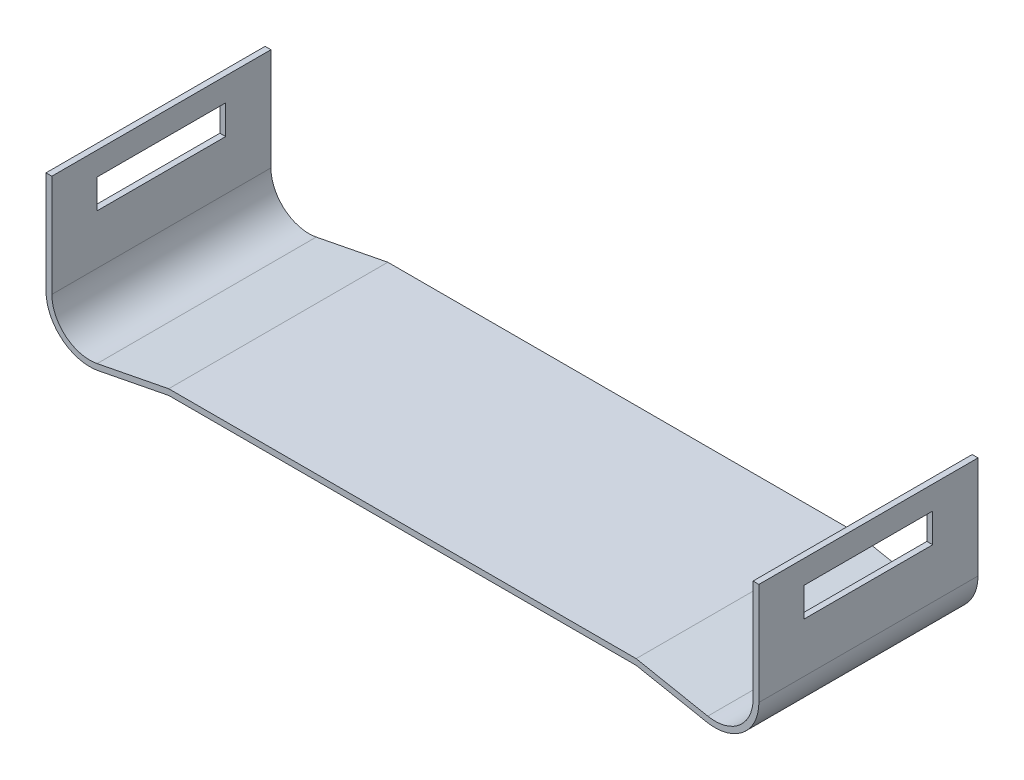
ISO-10303-21;
HEADER;
FILE_DESCRIPTION(('STEP AP214'),'2;1');
FILE_NAME('part.step','',(''),(''),'','','');
FILE_SCHEMA(('AUTOMOTIVE_DESIGN { 1 0 10303 214 1 1 1 1 }'));
ENDSEC;
DATA;
#1=APPLICATION_CONTEXT('core data for automotive mechanical design processes');
#2=APPLICATION_PROTOCOL_DEFINITION('international standard','automotive_design',2000,#1);
#3=PRODUCT_CONTEXT('',#1,'mechanical');
#4=PRODUCT('Part','Part','',(#3));
#5=PRODUCT_RELATED_PRODUCT_CATEGORY('part','',(#4));
#6=PRODUCT_DEFINITION_FORMATION('','',#4);
#7=PRODUCT_DEFINITION_CONTEXT('part definition',#1,'design');
#8=PRODUCT_DEFINITION('design','',#6,#7);
#9=PRODUCT_DEFINITION_SHAPE('','',#8);
#10=(LENGTH_UNIT() NAMED_UNIT(*) SI_UNIT(.MILLI.,.METRE.));
#11=(NAMED_UNIT(*) PLANE_ANGLE_UNIT() SI_UNIT($,.RADIAN.));
#12=(NAMED_UNIT(*) SI_UNIT($,.STERADIAN.) SOLID_ANGLE_UNIT());
#13=UNCERTAINTY_MEASURE_WITH_UNIT(LENGTH_MEASURE(1.E-05),#10,'distance_accuracy_value','');
#14=(GEOMETRIC_REPRESENTATION_CONTEXT(3) GLOBAL_UNCERTAINTY_ASSIGNED_CONTEXT((#13)) GLOBAL_UNIT_ASSIGNED_CONTEXT((#10,
#11,#12)) REPRESENTATION_CONTEXT('',''));
#15=CARTESIAN_POINT('',(0.,0.,0.));
#16=DIRECTION('',(0.,0.,1.));
#17=DIRECTION('',(1.,0.,0.));
#18=AXIS2_PLACEMENT_3D('',#15,#16,#17);
#19=CARTESIAN_POINT('',(-24.,-13.9,29.9));
#20=DIRECTION('',(0.,-1.,0.));
#21=DIRECTION('',(1.,0.,0.));
#22=AXIS2_PLACEMENT_3D('',#19,#20,#21);
#23=PLANE('',#22);
#24=DIRECTION('',(1.,0.,0.));
#25=VECTOR('',#24,1.);
#26=CARTESIAN_POINT('',(-24.,-13.9,29.9));
#27=LINE('',#26,#25);
#28=CARTESIAN_POINT('',(-24.,-13.9,29.9));
#29=VERTEX_POINT('',#28);
#30=CARTESIAN_POINT('',(-24.4,-13.9,29.9));
#31=VERTEX_POINT('',#30);
#32=EDGE_CURVE('E393',#29,#31,#27,.F.);
#33=ORIENTED_EDGE('',*,*,#32,.F.);
#34=DIRECTION('',(0.,0.,1.));
#35=VECTOR('',#34,1.);
#36=CARTESIAN_POINT('',(-24.,-13.9,29.9));
#37=LINE('',#36,#35);
#38=CARTESIAN_POINT('',(-24.,-13.9,14.9));
#39=VERTEX_POINT('',#38);
#40=EDGE_CURVE('E352',#29,#39,#37,.F.);
#41=ORIENTED_EDGE('',*,*,#40,.T.);
#42=DIRECTION('',(1.,0.,0.));
#43=VECTOR('',#42,1.);
#44=CARTESIAN_POINT('',(-24.,-13.9,14.9));
#45=LINE('',#44,#43);
#46=CARTESIAN_POINT('',(-24.4,-13.9,14.9));
#47=VERTEX_POINT('',#46);
#48=EDGE_CURVE('E394',#47,#39,#45,.T.);
#49=ORIENTED_EDGE('',*,*,#48,.F.);
#50=DIRECTION('',(0.,0.,1.));
#51=VECTOR('',#50,1.);
#52=CARTESIAN_POINT('',(-24.4,-13.9,29.9));
#53=LINE('',#52,#51);
#54=EDGE_CURVE('E335',#47,#31,#53,.T.);
#55=ORIENTED_EDGE('',*,*,#54,.T.);
#56=EDGE_LOOP('',(#33,#41,#49,#55));
#57=FACE_BOUND('',#56,.T.);
#58=ADVANCED_FACE('F17',(#57),#23,.F.);
#59=CARTESIAN_POINT('',(-24.4,-15.5,26.8));
#60=DIRECTION('',(0.,0.,1.));
#61=DIRECTION('',(0.,-1.,0.));
#62=AXIS2_PLACEMENT_3D('',#59,#60,#61);
#63=PLANE('',#62);
#64=DIRECTION('',(1.,0.,0.));
#65=VECTOR('',#64,1.);
#66=CARTESIAN_POINT('',(-24.4,-15.5,26.8));
#67=LINE('',#66,#65);
#68=CARTESIAN_POINT('',(-24.4,-15.5,26.8));
#69=VERTEX_POINT('',#68);
#70=CARTESIAN_POINT('',(-24.,-15.5,26.8));
#71=VERTEX_POINT('',#70);
#72=EDGE_CURVE('E391',#69,#71,#67,.T.);
#73=ORIENTED_EDGE('',*,*,#72,.T.);
#74=DIRECTION('',(0.,-1.,0.));
#75=VECTOR('',#74,1.);
#76=CARTESIAN_POINT('',(-24.,-20.90758976927,26.8));
#77=LINE('',#76,#75);
#78=CARTESIAN_POINT('',(-24.,-17.5,26.8));
#79=VERTEX_POINT('',#78);
#80=EDGE_CURVE('E343',#71,#79,#77,.T.);
#81=ORIENTED_EDGE('',*,*,#80,.T.);
#82=DIRECTION('',(1.,0.,0.));
#83=VECTOR('',#82,1.);
#84=CARTESIAN_POINT('',(-24.4,-17.5,26.8));
#85=LINE('',#84,#83);
#86=CARTESIAN_POINT('',(-24.4,-17.5,26.8));
#87=VERTEX_POINT('',#86);
#88=EDGE_CURVE('E378',#79,#87,#85,.F.);
#89=ORIENTED_EDGE('',*,*,#88,.T.);
#90=DIRECTION('',(0.,1.,0.));
#91=VECTOR('',#90,1.);
#92=CARTESIAN_POINT('',(-24.4,-13.9,26.8));
#93=LINE('',#92,#91);
#94=EDGE_CURVE('E332',#87,#69,#93,.T.);
#95=ORIENTED_EDGE('',*,*,#94,.T.);
#96=EDGE_LOOP('',(#73,#81,#89,#95));
#97=FACE_BOUND('',#96,.T.);
#98=ADVANCED_FACE('F542',(#97),#63,.F.);
#99=CARTESIAN_POINT('',(-24.4,-15.5,18.));
#100=DIRECTION('',(0.,1.,0.));
#101=DIRECTION('',(0.,0.,1.));
#102=AXIS2_PLACEMENT_3D('',#99,#100,#101);
#103=PLANE('',#102);
#104=DIRECTION('',(1.,0.,0.));
#105=VECTOR('',#104,1.);
#106=CARTESIAN_POINT('',(-24.4,-15.5,18.));
#107=LINE('',#106,#105);
#108=CARTESIAN_POINT('',(-24.4,-15.5,18.));
#109=VERTEX_POINT('',#108);
#110=CARTESIAN_POINT('',(-24.,-15.5,18.));
#111=VERTEX_POINT('',#110);
#112=EDGE_CURVE('E389',#109,#111,#107,.T.);
#113=ORIENTED_EDGE('',*,*,#112,.T.);
#114=DIRECTION('',(0.,0.,1.));
#115=VECTOR('',#114,1.);
#116=CARTESIAN_POINT('',(-24.,-15.5,29.9));
#117=LINE('',#116,#115);
#118=EDGE_CURVE('E346',#111,#71,#117,.T.);
#119=ORIENTED_EDGE('',*,*,#118,.T.);
#120=ORIENTED_EDGE('',*,*,#72,.F.);
#121=DIRECTION('',(0.,0.,1.));
#122=VECTOR('',#121,1.);
#123=CARTESIAN_POINT('',(-24.4,-15.5,29.9));
#124=LINE('',#123,#122);
#125=EDGE_CURVE('E329',#69,#109,#124,.F.);
#126=ORIENTED_EDGE('',*,*,#125,.T.);
#127=EDGE_LOOP('',(#113,#119,#120,#126));
#128=FACE_BOUND('',#127,.T.);
#129=ADVANCED_FACE('F539',(#128),#103,.F.);
#130=CARTESIAN_POINT('',(-24.4,-15.5,18.));
#131=DIRECTION('',(0.,0.,-1.));
#132=DIRECTION('',(0.,1.,0.));
#133=AXIS2_PLACEMENT_3D('',#130,#131,#132);
#134=PLANE('',#133);
#135=DIRECTION('',(1.,0.,0.));
#136=VECTOR('',#135,1.);
#137=CARTESIAN_POINT('',(-24.4,-17.5,18.));
#138=LINE('',#137,#136);
#139=CARTESIAN_POINT('',(-24.4,-17.5,18.));
#140=VERTEX_POINT('',#139);
#141=CARTESIAN_POINT('',(-24.,-17.5,18.));
#142=VERTEX_POINT('',#141);
#143=EDGE_CURVE('E386',#140,#142,#138,.T.);
#144=ORIENTED_EDGE('',*,*,#143,.T.);
#145=DIRECTION('',(0.,-1.,0.));
#146=VECTOR('',#145,1.);
#147=CARTESIAN_POINT('',(-24.,-20.90758976927,18.));
#148=LINE('',#147,#146);
#149=EDGE_CURVE('E349',#142,#111,#148,.F.);
#150=ORIENTED_EDGE('',*,*,#149,.T.);
#151=ORIENTED_EDGE('',*,*,#112,.F.);
#152=DIRECTION('',(0.,1.,0.));
#153=VECTOR('',#152,1.);
#154=CARTESIAN_POINT('',(-24.4,-13.9,18.));
#155=LINE('',#154,#153);
#156=EDGE_CURVE('E326',#109,#140,#155,.F.);
#157=ORIENTED_EDGE('',*,*,#156,.T.);
#158=EDGE_LOOP('',(#144,#150,#151,#157));
#159=FACE_BOUND('',#158,.T.);
#160=ADVANCED_FACE('F535',(#159),#134,.F.);
#161=CARTESIAN_POINT('',(-24.4,-17.5,18.));
#162=DIRECTION('',(0.,-1.,0.));
#163=DIRECTION('',(0.,0.,-1.));
#164=AXIS2_PLACEMENT_3D('',#161,#162,#163);
#165=PLANE('',#164);
#166=ORIENTED_EDGE('',*,*,#88,.F.);
#167=DIRECTION('',(0.,0.,1.));
#168=VECTOR('',#167,1.);
#169=CARTESIAN_POINT('',(-24.,-17.5,29.9));
#170=LINE('',#169,#168);
#171=EDGE_CURVE('E338',#79,#142,#170,.F.);
#172=ORIENTED_EDGE('',*,*,#171,.T.);
#173=ORIENTED_EDGE('',*,*,#143,.F.);
#174=DIRECTION('',(0.,0.,1.));
#175=VECTOR('',#174,1.);
#176=CARTESIAN_POINT('',(-24.4,-17.5,29.9));
#177=LINE('',#176,#175);
#178=EDGE_CURVE('E323',#140,#87,#177,.T.);
#179=ORIENTED_EDGE('',*,*,#178,.T.);
#180=EDGE_LOOP('',(#166,#172,#173,#179));
#181=FACE_BOUND('',#180,.T.);
#182=ADVANCED_FACE('F532',(#181),#165,.F.);
#183=CARTESIAN_POINT('',(24.,-13.9,29.9));
#184=DIRECTION('',(0.,-1.,0.));
#185=DIRECTION('',(1.,0.,0.));
#186=AXIS2_PLACEMENT_3D('',#183,#184,#185);
#187=PLANE('',#186);
#188=DIRECTION('',(1.,0.,0.));
#189=VECTOR('',#188,1.);
#190=CARTESIAN_POINT('',(24.,-13.9,29.9));
#191=LINE('',#190,#189);
#192=CARTESIAN_POINT('',(24.4,-13.9,29.9));
#193=VERTEX_POINT('',#192);
#194=CARTESIAN_POINT('',(24.,-13.9,29.9));
#195=VERTEX_POINT('',#194);
#196=EDGE_CURVE('E375',#193,#195,#191,.F.);
#197=ORIENTED_EDGE('',*,*,#196,.F.);
#198=DIRECTION('',(0.,0.,1.));
#199=VECTOR('',#198,1.);
#200=CARTESIAN_POINT('',(24.4,-13.9,29.9));
#201=LINE('',#200,#199);
#202=CARTESIAN_POINT('',(24.4,-13.9,14.9));
#203=VERTEX_POINT('',#202);
#204=EDGE_CURVE('E306',#193,#203,#201,.F.);
#205=ORIENTED_EDGE('',*,*,#204,.T.);
#206=DIRECTION('',(1.,0.,0.));
#207=VECTOR('',#206,1.);
#208=CARTESIAN_POINT('',(24.,-13.9,14.9));
#209=LINE('',#208,#207);
#210=CARTESIAN_POINT('',(24.,-13.9,14.9));
#211=VERTEX_POINT('',#210);
#212=EDGE_CURVE('E376',#211,#203,#209,.T.);
#213=ORIENTED_EDGE('',*,*,#212,.F.);
#214=DIRECTION('',(0.,0.,1.));
#215=VECTOR('',#214,1.);
#216=CARTESIAN_POINT('',(24.,-13.9,29.9));
#217=LINE('',#216,#215);
#218=EDGE_CURVE('E289',#211,#195,#217,.T.);
#219=ORIENTED_EDGE('',*,*,#218,.T.);
#220=EDGE_LOOP('',(#197,#205,#213,#219));
#221=FACE_BOUND('',#220,.T.);
#222=ADVANCED_FACE('F463',(#221),#187,.F.);
#223=CARTESIAN_POINT('',(-24.4,-15.5,26.8));
#224=DIRECTION('',(0.,0.,1.));
#225=DIRECTION('',(0.,-1.,0.));
#226=AXIS2_PLACEMENT_3D('',#223,#224,#225);
#227=PLANE('',#226);
#228=DIRECTION('',(1.,0.,0.));
#229=VECTOR('',#228,1.);
#230=CARTESIAN_POINT('',(-24.4,-17.5,26.8));
#231=LINE('',#230,#229);
#232=CARTESIAN_POINT('',(24.4,-17.5,26.8));
#233=VERTEX_POINT('',#232);
#234=CARTESIAN_POINT('',(24.,-17.5,26.8));
#235=VERTEX_POINT('',#234);
#236=EDGE_CURVE('E368',#233,#235,#231,.F.);
#237=ORIENTED_EDGE('',*,*,#236,.T.);
#238=DIRECTION('',(0.,1.,0.));
#239=VECTOR('',#238,1.);
#240=CARTESIAN_POINT('',(24.,-20.90758976927,26.8));
#241=LINE('',#240,#239);
#242=CARTESIAN_POINT('',(24.,-15.5,26.8));
#243=VERTEX_POINT('',#242);
#244=EDGE_CURVE('E286',#235,#243,#241,.T.);
#245=ORIENTED_EDGE('',*,*,#244,.T.);
#246=DIRECTION('',(1.,0.,0.));
#247=VECTOR('',#246,1.);
#248=CARTESIAN_POINT('',(-24.4,-15.5,26.8));
#249=LINE('',#248,#247);
#250=CARTESIAN_POINT('',(24.4,-15.5,26.8));
#251=VERTEX_POINT('',#250);
#252=EDGE_CURVE('E373',#243,#251,#249,.T.);
#253=ORIENTED_EDGE('',*,*,#252,.T.);
#254=DIRECTION('',(0.,-1.,0.));
#255=VECTOR('',#254,1.);
#256=CARTESIAN_POINT('',(24.4,-13.9,26.8));
#257=LINE('',#256,#255);
#258=EDGE_CURVE('E297',#251,#233,#257,.T.);
#259=ORIENTED_EDGE('',*,*,#258,.T.);
#260=EDGE_LOOP('',(#237,#245,#253,#259));
#261=FACE_BOUND('',#260,.T.);
#262=ADVANCED_FACE('F525',(#261),#227,.F.);
#263=CARTESIAN_POINT('',(-24.4,-15.5,18.));
#264=DIRECTION('',(0.,1.,0.));
#265=DIRECTION('',(0.,0.,1.));
#266=AXIS2_PLACEMENT_3D('',#263,#264,#265);
#267=PLANE('',#266);
#268=ORIENTED_EDGE('',*,*,#252,.F.);
#269=DIRECTION('',(0.,0.,1.));
#270=VECTOR('',#269,1.);
#271=CARTESIAN_POINT('',(24.,-15.5,29.9));
#272=LINE('',#271,#270);
#273=CARTESIAN_POINT('',(24.,-15.5,18.));
#274=VERTEX_POINT('',#273);
#275=EDGE_CURVE('E283',#243,#274,#272,.F.);
#276=ORIENTED_EDGE('',*,*,#275,.T.);
#277=DIRECTION('',(1.,0.,0.));
#278=VECTOR('',#277,1.);
#279=CARTESIAN_POINT('',(-24.4,-15.5,18.));
#280=LINE('',#279,#278);
#281=CARTESIAN_POINT('',(24.4,-15.5,18.));
#282=VERTEX_POINT('',#281);
#283=EDGE_CURVE('E371',#274,#282,#280,.T.);
#284=ORIENTED_EDGE('',*,*,#283,.T.);
#285=DIRECTION('',(0.,0.,1.));
#286=VECTOR('',#285,1.);
#287=CARTESIAN_POINT('',(24.4,-15.5,29.9));
#288=LINE('',#287,#286);
#289=EDGE_CURVE('E300',#282,#251,#288,.T.);
#290=ORIENTED_EDGE('',*,*,#289,.T.);
#291=EDGE_LOOP('',(#268,#276,#284,#290));
#292=FACE_BOUND('',#291,.T.);
#293=ADVANCED_FACE('F521',(#292),#267,.F.);
#294=CARTESIAN_POINT('',(-24.4,-15.5,18.));
#295=DIRECTION('',(0.,0.,-1.));
#296=DIRECTION('',(0.,1.,0.));
#297=AXIS2_PLACEMENT_3D('',#294,#295,#296);
#298=PLANE('',#297);
#299=ORIENTED_EDGE('',*,*,#283,.F.);
#300=DIRECTION('',(0.,1.,0.));
#301=VECTOR('',#300,1.);
#302=CARTESIAN_POINT('',(24.,-20.90758976927,18.));
#303=LINE('',#302,#301);
#304=CARTESIAN_POINT('',(24.,-17.5,18.));
#305=VERTEX_POINT('',#304);
#306=EDGE_CURVE('E280',#274,#305,#303,.F.);
#307=ORIENTED_EDGE('',*,*,#306,.T.);
#308=DIRECTION('',(1.,0.,0.));
#309=VECTOR('',#308,1.);
#310=CARTESIAN_POINT('',(-24.4,-17.5,18.));
#311=LINE('',#310,#309);
#312=CARTESIAN_POINT('',(24.4,-17.5,18.));
#313=VERTEX_POINT('',#312);
#314=EDGE_CURVE('E359',#305,#313,#311,.T.);
#315=ORIENTED_EDGE('',*,*,#314,.T.);
#316=DIRECTION('',(0.,-1.,0.));
#317=VECTOR('',#316,1.);
#318=CARTESIAN_POINT('',(24.4,-13.9,18.));
#319=LINE('',#318,#317);
#320=EDGE_CURVE('E303',#313,#282,#319,.F.);
#321=ORIENTED_EDGE('',*,*,#320,.T.);
#322=EDGE_LOOP('',(#299,#307,#315,#321));
#323=FACE_BOUND('',#322,.T.);
#324=ADVANCED_FACE('F517',(#323),#298,.F.);
#325=CARTESIAN_POINT('',(-24.4,-17.5,18.));
#326=DIRECTION('',(0.,-1.,0.));
#327=DIRECTION('',(0.,0.,-1.));
#328=AXIS2_PLACEMENT_3D('',#325,#326,#327);
#329=PLANE('',#328);
#330=ORIENTED_EDGE('',*,*,#314,.F.);
#331=DIRECTION('',(0.,0.,1.));
#332=VECTOR('',#331,1.);
#333=CARTESIAN_POINT('',(24.,-17.5,29.9));
#334=LINE('',#333,#332);
#335=EDGE_CURVE('E277',#305,#235,#334,.T.);
#336=ORIENTED_EDGE('',*,*,#335,.T.);
#337=ORIENTED_EDGE('',*,*,#236,.F.);
#338=DIRECTION('',(0.,0.,1.));
#339=VECTOR('',#338,1.);
#340=CARTESIAN_POINT('',(24.4,-17.5,29.9));
#341=LINE('',#340,#339);
#342=EDGE_CURVE('E292',#233,#313,#341,.F.);
#343=ORIENTED_EDGE('',*,*,#342,.T.);
#344=EDGE_LOOP('',(#330,#336,#337,#343));
#345=FACE_BOUND('',#344,.T.);
#346=ADVANCED_FACE('F514',(#345),#329,.F.);
#347=CARTESIAN_POINT('',(16.,-22.5,29.9));
#348=DIRECTION('',(0.,-1.,0.));
#349=DIRECTION('',(0.,0.,-1.));
#350=AXIS2_PLACEMENT_3D('',#347,#348,#349);
#351=PLANE('',#350);
#352=DIRECTION('',(1.,0.,0.));
#353=VECTOR('',#352,1.);
#354=CARTESIAN_POINT('',(-21.4,-22.5,29.9));
#355=LINE('',#354,#353);
#356=CARTESIAN_POINT('',(16.0000000000001,-22.5,29.9));
#357=VERTEX_POINT('',#356);
#358=CARTESIAN_POINT('',(-16.,-22.5,29.9));
#359=VERTEX_POINT('',#358);
#360=EDGE_CURVE('E270',#357,#359,#355,.F.);
#361=ORIENTED_EDGE('',*,*,#360,.F.);
#362=DIRECTION('',(0.,0.,1.));
#363=VECTOR('',#362,1.);
#364=CARTESIAN_POINT('',(16.,-22.5,29.9));
#365=LINE('',#364,#363);
#366=CARTESIAN_POINT('',(16.,-22.5,14.9));
#367=VERTEX_POINT('',#366);
#368=EDGE_CURVE('E186',#357,#367,#365,.F.);
#369=ORIENTED_EDGE('',*,*,#368,.T.);
#370=DIRECTION('',(1.,0.,0.));
#371=VECTOR('',#370,1.);
#372=CARTESIAN_POINT('',(-21.4,-22.5,14.9));
#373=LINE('',#372,#371);
#374=CARTESIAN_POINT('',(-16.,-22.5,14.9));
#375=VERTEX_POINT('',#374);
#376=EDGE_CURVE('E201',#367,#375,#373,.F.);
#377=ORIENTED_EDGE('',*,*,#376,.T.);
#378=DIRECTION('',(0.,0.,1.));
#379=VECTOR('',#378,1.);
#380=CARTESIAN_POINT('',(-16.,-22.5,29.9));
#381=LINE('',#380,#379);
#382=EDGE_CURVE('E196',#375,#359,#381,.T.);
#383=ORIENTED_EDGE('',*,*,#382,.T.);
#384=EDGE_LOOP('',(#361,#369,#377,#383));
#385=FACE_BOUND('',#384,.T.);
#386=ADVANCED_FACE('F448',(#385),#351,.F.);
#387=CARTESIAN_POINT('',(-16.,-22.5,29.9));
#388=DIRECTION('',(0.192081888360959,-0.981378901425789,0.));
#389=DIRECTION('',(0.981378901425789,0.192081888360959,0.));
#390=AXIS2_PLACEMENT_3D('',#387,#388,#389);
#391=PLANE('',#390);
#392=DIRECTION('',(-0.981378901426127,-0.192081888359229,0.));
#393=VECTOR('',#392,1.);
#394=CARTESIAN_POINT('',(-16.,-22.5,29.9));
#395=LINE('',#394,#393);
#396=CARTESIAN_POINT('',(-20.9005870902628,-23.459174912975,29.9));
#397=VERTEX_POINT('',#396);
#398=EDGE_CURVE('E272',#359,#397,#395,.T.);
#399=ORIENTED_EDGE('',*,*,#398,.F.);
#400=ORIENTED_EDGE('',*,*,#382,.F.);
#401=DIRECTION('',(-0.981378901426127,-0.192081888359229,0.));
#402=VECTOR('',#401,1.);
#403=CARTESIAN_POINT('',(-16.,-22.5,14.9));
#404=LINE('',#403,#402);
#405=CARTESIAN_POINT('',(-20.9005870902628,-23.459174912975,14.9));
#406=VERTEX_POINT('',#405);
#407=EDGE_CURVE('E180',#375,#406,#404,.T.);
#408=ORIENTED_EDGE('',*,*,#407,.T.);
#409=DIRECTION('',(0.,0.,1.));
#410=VECTOR('',#409,1.);
#411=CARTESIAN_POINT('',(-20.9005870902583,-23.4591749129786,29.9));
#412=LINE('',#411,#410);
#413=EDGE_CURVE('E189',#397,#406,#412,.F.);
#414=ORIENTED_EDGE('',*,*,#413,.F.);
#415=EDGE_LOOP('',(#399,#400,#408,#414));
#416=FACE_BOUND('',#415,.T.);
#417=ADVANCED_FACE('F198',(#416),#391,.F.);
#418=CARTESIAN_POINT('',(-21.4,-20.90758976927,29.9));
#419=DIRECTION('',(0.,0.,1.));
#420=DIRECTION('',(0.,-1.,0.));
#421=AXIS2_PLACEMENT_3D('',#418,#419,#420);
#422=CYLINDRICAL_SURFACE('',#421,2.6);
#423=CARTESIAN_POINT('',(-21.4,-20.90758976927,14.9));
#424=DIRECTION('',(0.,0.,1.));
#425=DIRECTION('',(0.,-1.,0.));
#426=AXIS2_PLACEMENT_3D('',#423,#424,#425);
#427=CIRCLE('',#426,2.6);
#428=CARTESIAN_POINT('',(-24.,-20.90758976927,14.9));
#429=VERTEX_POINT('',#428);
#430=EDGE_CURVE('E20',#406,#429,#427,.F.);
#431=ORIENTED_EDGE('',*,*,#430,.T.);
#432=DIRECTION('',(0.,0.,1.));
#433=VECTOR('',#432,1.);
#434=CARTESIAN_POINT('',(-24.,-20.90758976927,29.9));
#435=LINE('',#434,#433);
#436=CARTESIAN_POINT('',(-24.,-20.90758976927,29.9));
#437=VERTEX_POINT('',#436);
#438=EDGE_CURVE('E195',#429,#437,#435,.T.);
#439=ORIENTED_EDGE('',*,*,#438,.T.);
#440=CARTESIAN_POINT('',(-21.4,-20.90758976927,29.9));
#441=DIRECTION('',(0.,0.,1.));
#442=DIRECTION('',(0.,-1.,0.));
#443=AXIS2_PLACEMENT_3D('',#440,#441,#442);
#444=CIRCLE('',#443,2.6);
#445=EDGE_CURVE('E191',#397,#437,#444,.F.);
#446=ORIENTED_EDGE('',*,*,#445,.F.);
#447=ORIENTED_EDGE('',*,*,#413,.T.);
#448=EDGE_LOOP('',(#431,#439,#446,#447));
#449=FACE_BOUND('',#448,.T.);
#450=ADVANCED_FACE('F190',(#449),#422,.F.);
#451=CARTESIAN_POINT('',(-24.,-20.90758976927,29.9));
#452=DIRECTION('',(-1.,0.,0.));
#453=DIRECTION('',(0.,-1.,0.));
#454=AXIS2_PLACEMENT_3D('',#451,#452,#453);
#455=PLANE('',#454);
#456=ORIENTED_EDGE('',*,*,#80,.F.);
#457=ORIENTED_EDGE('',*,*,#118,.F.);
#458=ORIENTED_EDGE('',*,*,#149,.F.);
#459=ORIENTED_EDGE('',*,*,#171,.F.);
#460=EDGE_LOOP('',(#456,#457,#458,#459));
#461=FACE_BOUND('',#460,.T.);
#462=DIRECTION('',(0.,-1.,0.));
#463=VECTOR('',#462,1.);
#464=CARTESIAN_POINT('',(-24.,-20.90758976927,29.9));
#465=LINE('',#464,#463);
#466=EDGE_CURVE('E412',#437,#29,#465,.F.);
#467=ORIENTED_EDGE('',*,*,#466,.F.);
#468=ORIENTED_EDGE('',*,*,#438,.F.);
#469=DIRECTION('',(0.,-1.,0.));
#470=VECTOR('',#469,1.);
#471=CARTESIAN_POINT('',(-24.,-20.90758976927,14.9));
#472=LINE('',#471,#470);
#473=EDGE_CURVE('E183',#429,#39,#472,.F.);
#474=ORIENTED_EDGE('',*,*,#473,.T.);
#475=ORIENTED_EDGE('',*,*,#40,.F.);
#476=EDGE_LOOP('',(#467,#468,#474,#475));
#477=FACE_BOUND('',#476,.T.);
#478=ADVANCED_FACE('F503',(#461,#477),#455,.F.);
#479=CARTESIAN_POINT('',(-24.4,-13.9,29.9));
#480=DIRECTION('',(1.,0.,0.));
#481=DIRECTION('',(0.,1.,0.));
#482=AXIS2_PLACEMENT_3D('',#479,#480,#481);
#483=PLANE('',#482);
#484=ORIENTED_EDGE('',*,*,#156,.F.);
#485=ORIENTED_EDGE('',*,*,#125,.F.);
#486=ORIENTED_EDGE('',*,*,#94,.F.);
#487=ORIENTED_EDGE('',*,*,#178,.F.);
#488=EDGE_LOOP('',(#484,#485,#486,#487));
#489=FACE_BOUND('',#488,.T.);
#490=DIRECTION('',(0.,-1.,0.));
#491=VECTOR('',#490,1.);
#492=CARTESIAN_POINT('',(-24.4,-20.90758976927,29.9));
#493=LINE('',#492,#491);
#494=CARTESIAN_POINT('',(-24.4,-20.9,29.9));
#495=VERTEX_POINT('',#494);
#496=EDGE_CURVE('E410',#31,#495,#493,.T.);
#497=ORIENTED_EDGE('',*,*,#496,.F.);
#498=ORIENTED_EDGE('',*,*,#54,.F.);
#499=DIRECTION('',(0.,-1.,0.));
#500=VECTOR('',#499,1.);
#501=CARTESIAN_POINT('',(-24.4,-20.90758976927,14.9));
#502=LINE('',#501,#500);
#503=CARTESIAN_POINT('',(-24.4,-20.9,14.9));
#504=VERTEX_POINT('',#503);
#505=EDGE_CURVE('E230',#47,#504,#502,.T.);
#506=ORIENTED_EDGE('',*,*,#505,.T.);
#507=DIRECTION('',(0.,0.,1.));
#508=VECTOR('',#507,1.);
#509=CARTESIAN_POINT('',(-24.4,-20.9,29.9));
#510=LINE('',#509,#508);
#511=EDGE_CURVE('E310',#495,#504,#510,.F.);
#512=ORIENTED_EDGE('',*,*,#511,.F.);
#513=EDGE_LOOP('',(#497,#498,#506,#512));
#514=FACE_BOUND('',#513,.T.);
#515=ADVANCED_FACE('F500',(#489,#514),#483,.F.);
#516=CARTESIAN_POINT('',(-21.4,-20.9,29.9));
#517=DIRECTION('',(0.,0.,1.));
#518=DIRECTION('',(0.,-1.,0.));
#519=AXIS2_PLACEMENT_3D('',#516,#517,#518);
#520=CYLINDRICAL_SURFACE('',#519,3.);
#521=CARTESIAN_POINT('',(-21.4,-20.9,29.9));
#522=DIRECTION('',(0.,0.,1.));
#523=DIRECTION('',(0.,-1.,0.));
#524=AXIS2_PLACEMENT_3D('',#521,#522,#523);
#525=CIRCLE('',#524,3.);
#526=CARTESIAN_POINT('',(-20.8237543349155,-23.8441367042744,29.9));
#527=VERTEX_POINT('',#526);
#528=EDGE_CURVE('E408',#495,#527,#525,.T.);
#529=ORIENTED_EDGE('',*,*,#528,.F.);
#530=ORIENTED_EDGE('',*,*,#511,.T.);
#531=CARTESIAN_POINT('',(-21.4,-20.9,14.9));
#532=DIRECTION('',(0.,0.,1.));
#533=DIRECTION('',(0.,-1.,0.));
#534=AXIS2_PLACEMENT_3D('',#531,#532,#533);
#535=CIRCLE('',#534,3.);
#536=CARTESIAN_POINT('',(-20.8237543349129,-23.8441367042773,14.9));
#537=VERTEX_POINT('',#536);
#538=EDGE_CURVE('E233',#504,#537,#535,.T.);
#539=ORIENTED_EDGE('',*,*,#538,.T.);
#540=DIRECTION('',(0.,0.,1.));
#541=VECTOR('',#540,1.);
#542=CARTESIAN_POINT('',(-20.8237543349087,-23.8441367042765,29.9));
#543=LINE('',#542,#541);
#544=EDGE_CURVE('E204',#537,#527,#543,.T.);
#545=ORIENTED_EDGE('',*,*,#544,.T.);
#546=EDGE_LOOP('',(#529,#530,#539,#545));
#547=FACE_BOUND('',#546,.T.);
#548=ADVANCED_FACE('F418',(#547),#520,.T.);
#549=CARTESIAN_POINT('',(24.4,-13.9,29.9));
#550=DIRECTION('',(-1.,0.,0.));
#551=DIRECTION('',(0.,-1.,0.));
#552=AXIS2_PLACEMENT_3D('',#549,#550,#551);
#553=PLANE('',#552);
#554=ORIENTED_EDGE('',*,*,#258,.F.);
#555=ORIENTED_EDGE('',*,*,#289,.F.);
#556=ORIENTED_EDGE('',*,*,#320,.F.);
#557=ORIENTED_EDGE('',*,*,#342,.F.);
#558=EDGE_LOOP('',(#554,#555,#556,#557));
#559=FACE_BOUND('',#558,.T.);
#560=DIRECTION('',(0.,-1.,0.));
#561=VECTOR('',#560,1.);
#562=CARTESIAN_POINT('',(24.4,-20.90758976927,29.9));
#563=LINE('',#562,#561);
#564=CARTESIAN_POINT('',(24.4,-20.9,29.9));
#565=VERTEX_POINT('',#564);
#566=EDGE_CURVE('E406',#565,#193,#563,.F.);
#567=ORIENTED_EDGE('',*,*,#566,.F.);
#568=DIRECTION('',(0.,0.,1.));
#569=VECTOR('',#568,1.);
#570=CARTESIAN_POINT('',(24.4,-20.9,29.9));
#571=LINE('',#570,#569);
#572=CARTESIAN_POINT('',(24.4,-20.9,14.9));
#573=VERTEX_POINT('',#572);
#574=EDGE_CURVE('E307',#573,#565,#571,.T.);
#575=ORIENTED_EDGE('',*,*,#574,.F.);
#576=DIRECTION('',(0.,-1.,0.));
#577=VECTOR('',#576,1.);
#578=CARTESIAN_POINT('',(24.4,-20.90758976927,14.9));
#579=LINE('',#578,#577);
#580=EDGE_CURVE('E222',#573,#203,#579,.F.);
#581=ORIENTED_EDGE('',*,*,#580,.T.);
#582=ORIENTED_EDGE('',*,*,#204,.F.);
#583=EDGE_LOOP('',(#567,#575,#581,#582));
#584=FACE_BOUND('',#583,.T.);
#585=ADVANCED_FACE('F493',(#559,#584),#553,.F.);
#586=CARTESIAN_POINT('',(24.,-20.90758976927,29.9));
#587=DIRECTION('',(1.,0.,0.));
#588=DIRECTION('',(0.,1.,0.));
#589=AXIS2_PLACEMENT_3D('',#586,#587,#588);
#590=PLANE('',#589);
#591=ORIENTED_EDGE('',*,*,#306,.F.);
#592=ORIENTED_EDGE('',*,*,#275,.F.);
#593=ORIENTED_EDGE('',*,*,#244,.F.);
#594=ORIENTED_EDGE('',*,*,#335,.F.);
#595=EDGE_LOOP('',(#591,#592,#593,#594));
#596=FACE_BOUND('',#595,.T.);
#597=DIRECTION('',(0.,-1.,0.));
#598=VECTOR('',#597,1.);
#599=CARTESIAN_POINT('',(24.,-20.90758976927,29.9));
#600=LINE('',#599,#598);
#601=CARTESIAN_POINT('',(24.,-20.90758976927,29.9));
#602=VERTEX_POINT('',#601);
#603=EDGE_CURVE('E403',#195,#602,#600,.T.);
#604=ORIENTED_EDGE('',*,*,#603,.F.);
#605=ORIENTED_EDGE('',*,*,#218,.F.);
#606=DIRECTION('',(0.,-1.,0.));
#607=VECTOR('',#606,1.);
#608=CARTESIAN_POINT('',(24.,-20.90758976927,14.9));
#609=LINE('',#608,#607);
#610=CARTESIAN_POINT('',(24.,-20.90758976927,14.9));
#611=VERTEX_POINT('',#610);
#612=EDGE_CURVE('E219',#211,#611,#609,.T.);
#613=ORIENTED_EDGE('',*,*,#612,.T.);
#614=DIRECTION('',(0.,0.,1.));
#615=VECTOR('',#614,1.);
#616=CARTESIAN_POINT('',(24.,-20.90758976927,29.9));
#617=LINE('',#616,#615);
#618=EDGE_CURVE('E266',#611,#602,#617,.T.);
#619=ORIENTED_EDGE('',*,*,#618,.T.);
#620=EDGE_LOOP('',(#604,#605,#613,#619));
#621=FACE_BOUND('',#620,.T.);
#622=ADVANCED_FACE('F461',(#596,#621),#590,.F.);
#623=CARTESIAN_POINT('',(21.4,-20.90758976927,29.9));
#624=DIRECTION('',(0.,0.,1.));
#625=DIRECTION('',(0.,-1.,0.));
#626=AXIS2_PLACEMENT_3D('',#623,#624,#625);
#627=CYLINDRICAL_SURFACE('',#626,2.6);
#628=CARTESIAN_POINT('',(21.4,-20.90758976927,14.9));
#629=DIRECTION('',(0.,0.,1.));
#630=DIRECTION('',(0.,-1.,0.));
#631=AXIS2_PLACEMENT_3D('',#628,#629,#630);
#632=CIRCLE('',#631,2.6);
#633=CARTESIAN_POINT('',(20.9005870902639,-23.459174912975,14.9));
#634=VERTEX_POINT('',#633);
#635=EDGE_CURVE('E216',#611,#634,#632,.F.);
#636=ORIENTED_EDGE('',*,*,#635,.T.);
#637=DIRECTION('',(0.,0.,1.));
#638=VECTOR('',#637,1.);
#639=CARTESIAN_POINT('',(20.9005870902602,-23.459174912979,29.9));
#640=LINE('',#639,#638);
#641=CARTESIAN_POINT('',(20.9005870902639,-23.459174912975,29.9));
#642=VERTEX_POINT('',#641);
#643=EDGE_CURVE('E263',#634,#642,#640,.T.);
#644=ORIENTED_EDGE('',*,*,#643,.T.);
#645=CARTESIAN_POINT('',(21.4,-20.90758976927,29.9));
#646=DIRECTION('',(0.,0.,1.));
#647=DIRECTION('',(0.,-1.,0.));
#648=AXIS2_PLACEMENT_3D('',#645,#646,#647);
#649=CIRCLE('',#648,2.6);
#650=EDGE_CURVE('E401',#602,#642,#649,.F.);
#651=ORIENTED_EDGE('',*,*,#650,.F.);
#652=ORIENTED_EDGE('',*,*,#618,.F.);
#653=EDGE_LOOP('',(#636,#644,#651,#652));
#654=FACE_BOUND('',#653,.T.);
#655=ADVANCED_FACE('F456',(#654),#627,.F.);
#656=CARTESIAN_POINT('',(16.,-22.5,29.9));
#657=DIRECTION('',(-0.192081888360959,-0.981378901425789,0.));
#658=DIRECTION('',(0.981378901425789,-0.192081888360959,0.));
#659=AXIS2_PLACEMENT_3D('',#656,#657,#658);
#660=PLANE('',#659);
#661=DIRECTION('',(-0.981378901426142,0.192081888359154,0.));
#662=VECTOR('',#661,1.);
#663=CARTESIAN_POINT('',(20.900587090262,-23.45917491297,29.9));
#664=LINE('',#663,#662);
#665=EDGE_CURVE('E256',#642,#357,#664,.T.);
#666=ORIENTED_EDGE('',*,*,#665,.F.);
#667=ORIENTED_EDGE('',*,*,#643,.F.);
#668=DIRECTION('',(-0.981378901426142,0.192081888359154,0.));
#669=VECTOR('',#668,1.);
#670=CARTESIAN_POINT('',(20.900587090262,-23.45917491297,14.9));
#671=LINE('',#670,#669);
#672=EDGE_CURVE('E206',#634,#367,#671,.T.);
#673=ORIENTED_EDGE('',*,*,#672,.T.);
#674=ORIENTED_EDGE('',*,*,#368,.F.);
#675=EDGE_LOOP('',(#666,#667,#673,#674));
#676=FACE_BOUND('',#675,.T.);
#677=ADVANCED_FACE('F453',(#676),#660,.F.);
#678=CARTESIAN_POINT('',(21.4,-20.9,29.9));
#679=DIRECTION('',(0.,0.,1.));
#680=DIRECTION('',(0.,-1.,0.));
#681=AXIS2_PLACEMENT_3D('',#678,#679,#680);
#682=CYLINDRICAL_SURFACE('',#681,3.);
#683=CARTESIAN_POINT('',(21.4,-20.9,29.9));
#684=DIRECTION('',(0.,0.,1.));
#685=DIRECTION('',(0.,-1.,0.));
#686=AXIS2_PLACEMENT_3D('',#683,#684,#685);
#687=CIRCLE('',#686,3.);
#688=CARTESIAN_POINT('',(20.8237543349167,-23.8441367042781,29.9));
#689=VERTEX_POINT('',#688);
#690=EDGE_CURVE('E404',#689,#565,#687,.T.);
#691=ORIENTED_EDGE('',*,*,#690,.F.);
#692=DIRECTION('',(0.,0.,1.));
#693=VECTOR('',#692,1.);
#694=CARTESIAN_POINT('',(20.8237543349164,-23.844136704278,29.9));
#695=LINE('',#694,#693);
#696=CARTESIAN_POINT('',(20.8237543349167,-23.8441367042781,14.9));
#697=VERTEX_POINT('',#696);
#698=EDGE_CURVE('E239',#689,#697,#695,.F.);
#699=ORIENTED_EDGE('',*,*,#698,.T.);
#700=CARTESIAN_POINT('',(21.4,-20.9,14.9));
#701=DIRECTION('',(0.,0.,1.));
#702=DIRECTION('',(0.,-1.,0.));
#703=AXIS2_PLACEMENT_3D('',#700,#701,#702);
#704=CIRCLE('',#703,3.);
#705=EDGE_CURVE('E227',#697,#573,#704,.T.);
#706=ORIENTED_EDGE('',*,*,#705,.T.);
#707=ORIENTED_EDGE('',*,*,#574,.T.);
#708=EDGE_LOOP('',(#691,#699,#706,#707));
#709=FACE_BOUND('',#708,.T.);
#710=ADVANCED_FACE('F468',(#709),#682,.T.);
#711=CARTESIAN_POINT('',(-21.4,-20.90758976927,14.9));
#712=DIRECTION('',(0.,0.,1.));
#713=DIRECTION('',(0.,-1.,0.));
#714=AXIS2_PLACEMENT_3D('',#711,#712,#713);
#715=PLANE('',#714);
#716=ORIENTED_EDGE('',*,*,#376,.F.);
#717=ORIENTED_EDGE('',*,*,#672,.F.);
#718=ORIENTED_EDGE('',*,*,#635,.F.);
#719=ORIENTED_EDGE('',*,*,#612,.F.);
#720=ORIENTED_EDGE('',*,*,#212,.T.);
#721=ORIENTED_EDGE('',*,*,#580,.F.);
#722=ORIENTED_EDGE('',*,*,#705,.F.);
#723=DIRECTION('',(-0.981378901425789,0.192081888360959,0.));
#724=VECTOR('',#723,1.);
#725=CARTESIAN_POINT('',(16.,-22.9,14.9));
#726=LINE('',#725,#724);
#727=CARTESIAN_POINT('',(16.0000000000001,-22.9,14.9));
#728=VERTEX_POINT('',#727);
#729=EDGE_CURVE('E244',#697,#728,#726,.T.);
#730=ORIENTED_EDGE('',*,*,#729,.T.);
#731=DIRECTION('',(1.,0.,0.));
#732=VECTOR('',#731,1.);
#733=CARTESIAN_POINT('',(16.,-22.9,14.9));
#734=LINE('',#733,#732);
#735=CARTESIAN_POINT('',(-16.,-22.9,14.9));
#736=VERTEX_POINT('',#735);
#737=EDGE_CURVE('E242',#728,#736,#734,.F.);
#738=ORIENTED_EDGE('',*,*,#737,.T.);
#739=DIRECTION('',(-0.981378901425789,-0.192081888360959,0.));
#740=VECTOR('',#739,1.);
#741=CARTESIAN_POINT('',(-16.,-22.9,14.9));
#742=LINE('',#741,#740);
#743=EDGE_CURVE('E200',#736,#537,#742,.T.);
#744=ORIENTED_EDGE('',*,*,#743,.T.);
#745=ORIENTED_EDGE('',*,*,#538,.F.);
#746=ORIENTED_EDGE('',*,*,#505,.F.);
#747=ORIENTED_EDGE('',*,*,#48,.T.);
#748=ORIENTED_EDGE('',*,*,#473,.F.);
#749=ORIENTED_EDGE('',*,*,#430,.F.);
#750=ORIENTED_EDGE('',*,*,#407,.F.);
#751=EDGE_LOOP('',(#716,#717,#718,#719,#720,#721,#722,#730,#738,#744,#745,#746,#747,#748,#749,#750));
#752=FACE_BOUND('',#751,.T.);
#753=ADVANCED_FACE('F178',(#752),#715,.F.);
#754=CARTESIAN_POINT('',(-16.,-22.9,29.9));
#755=DIRECTION('',(-0.192081888360959,0.981378901425789,0.));
#756=DIRECTION('',(-0.981378901425789,-0.192081888360959,0.));
#757=AXIS2_PLACEMENT_3D('',#754,#755,#756);
#758=PLANE('',#757);
#759=DIRECTION('',(0.981378901426047,0.192081888359637,0.));
#760=VECTOR('',#759,1.);
#761=CARTESIAN_POINT('',(-20.82375433491,-23.84413670427,29.9));
#762=LINE('',#761,#760);
#763=CARTESIAN_POINT('',(-16.,-22.9,29.9));
#764=VERTEX_POINT('',#763);
#765=EDGE_CURVE('E407',#527,#764,#762,.T.);
#766=ORIENTED_EDGE('',*,*,#765,.F.);
#767=ORIENTED_EDGE('',*,*,#544,.F.);
#768=ORIENTED_EDGE('',*,*,#743,.F.);
#769=DIRECTION('',(0.,0.,1.));
#770=VECTOR('',#769,1.);
#771=CARTESIAN_POINT('',(-16.,-22.9,29.9));
#772=LINE('',#771,#770);
#773=EDGE_CURVE('E251',#736,#764,#772,.T.);
#774=ORIENTED_EDGE('',*,*,#773,.T.);
#775=EDGE_LOOP('',(#766,#767,#768,#774));
#776=FACE_BOUND('',#775,.T.);
#777=ADVANCED_FACE('F423',(#776),#758,.F.);
#778=CARTESIAN_POINT('',(-21.4,-20.90758976927,29.9));
#779=DIRECTION('',(0.,0.,1.));
#780=DIRECTION('',(0.,-1.,0.));
#781=AXIS2_PLACEMENT_3D('',#778,#779,#780);
#782=PLANE('',#781);
#783=ORIENTED_EDGE('',*,*,#650,.T.);
#784=ORIENTED_EDGE('',*,*,#665,.T.);
#785=ORIENTED_EDGE('',*,*,#360,.T.);
#786=ORIENTED_EDGE('',*,*,#398,.T.);
#787=ORIENTED_EDGE('',*,*,#445,.T.);
#788=ORIENTED_EDGE('',*,*,#466,.T.);
#789=ORIENTED_EDGE('',*,*,#32,.T.);
#790=ORIENTED_EDGE('',*,*,#496,.T.);
#791=ORIENTED_EDGE('',*,*,#528,.T.);
#792=ORIENTED_EDGE('',*,*,#765,.T.);
#793=DIRECTION('',(1.,0.,0.));
#794=VECTOR('',#793,1.);
#795=CARTESIAN_POINT('',(16.,-22.9,29.9));
#796=LINE('',#795,#794);
#797=CARTESIAN_POINT('',(16.0000000000001,-22.9,29.9));
#798=VERTEX_POINT('',#797);
#799=EDGE_CURVE('E26',#764,#798,#796,.T.);
#800=ORIENTED_EDGE('',*,*,#799,.T.);
#801=DIRECTION('',(-0.981378901425789,0.192081888360959,0.));
#802=VECTOR('',#801,1.);
#803=CARTESIAN_POINT('',(16.,-22.9,29.9));
#804=LINE('',#803,#802);
#805=EDGE_CURVE('E34',#798,#689,#804,.F.);
#806=ORIENTED_EDGE('',*,*,#805,.T.);
#807=ORIENTED_EDGE('',*,*,#690,.T.);
#808=ORIENTED_EDGE('',*,*,#566,.T.);
#809=ORIENTED_EDGE('',*,*,#196,.T.);
#810=ORIENTED_EDGE('',*,*,#603,.T.);
#811=EDGE_LOOP('',(#783,#784,#785,#786,#787,#788,#789,#790,#791,#792,#800,#806,#807,#808,#809,#810));
#812=FACE_BOUND('',#811,.T.);
#813=ADVANCED_FACE('F430',(#812),#782,.T.);
#814=CARTESIAN_POINT('',(16.,-22.9,29.9));
#815=DIRECTION('',(0.192081888360959,0.981378901425789,0.));
#816=DIRECTION('',(-0.981378901425789,0.192081888360959,0.));
#817=AXIS2_PLACEMENT_3D('',#814,#815,#816);
#818=PLANE('',#817);
#819=ORIENTED_EDGE('',*,*,#805,.F.);
#820=DIRECTION('',(0.,0.,1.));
#821=VECTOR('',#820,1.);
#822=CARTESIAN_POINT('',(16.,-22.9,29.9));
#823=LINE('',#822,#821);
#824=EDGE_CURVE('E11',#798,#728,#823,.F.);
#825=ORIENTED_EDGE('',*,*,#824,.T.);
#826=ORIENTED_EDGE('',*,*,#729,.F.);
#827=ORIENTED_EDGE('',*,*,#698,.F.);
#828=EDGE_LOOP('',(#819,#825,#826,#827));
#829=FACE_BOUND('',#828,.T.);
#830=ADVANCED_FACE('F470',(#829),#818,.F.);
#831=CARTESIAN_POINT('',(16.,-22.9,29.9));
#832=DIRECTION('',(0.,1.,0.));
#833=DIRECTION('',(0.,0.,1.));
#834=AXIS2_PLACEMENT_3D('',#831,#832,#833);
#835=PLANE('',#834);
#836=ORIENTED_EDGE('',*,*,#799,.F.);
#837=ORIENTED_EDGE('',*,*,#773,.F.);
#838=ORIENTED_EDGE('',*,*,#737,.F.);
#839=ORIENTED_EDGE('',*,*,#824,.F.);
#840=EDGE_LOOP('',(#836,#837,#838,#839));
#841=FACE_BOUND('',#840,.T.);
#842=ADVANCED_FACE('F428',(#841),#835,.F.);
#843=CLOSED_SHELL('',(#58,#98,#129,#160,#182,#222,#262,#293,#324,#346,#386,#417,#450,#478,#515,
#548,#585,#622,#655,#677,#710,#753,#777,#813,#830,#842));
#844=MANIFOLD_SOLID_BREP('B1',#843);
#845=ADVANCED_BREP_SHAPE_REPRESENTATION('',(#18,#844),#14);
#846=SHAPE_DEFINITION_REPRESENTATION(#9,#845);
ENDSEC;
END-ISO-10303-21;
